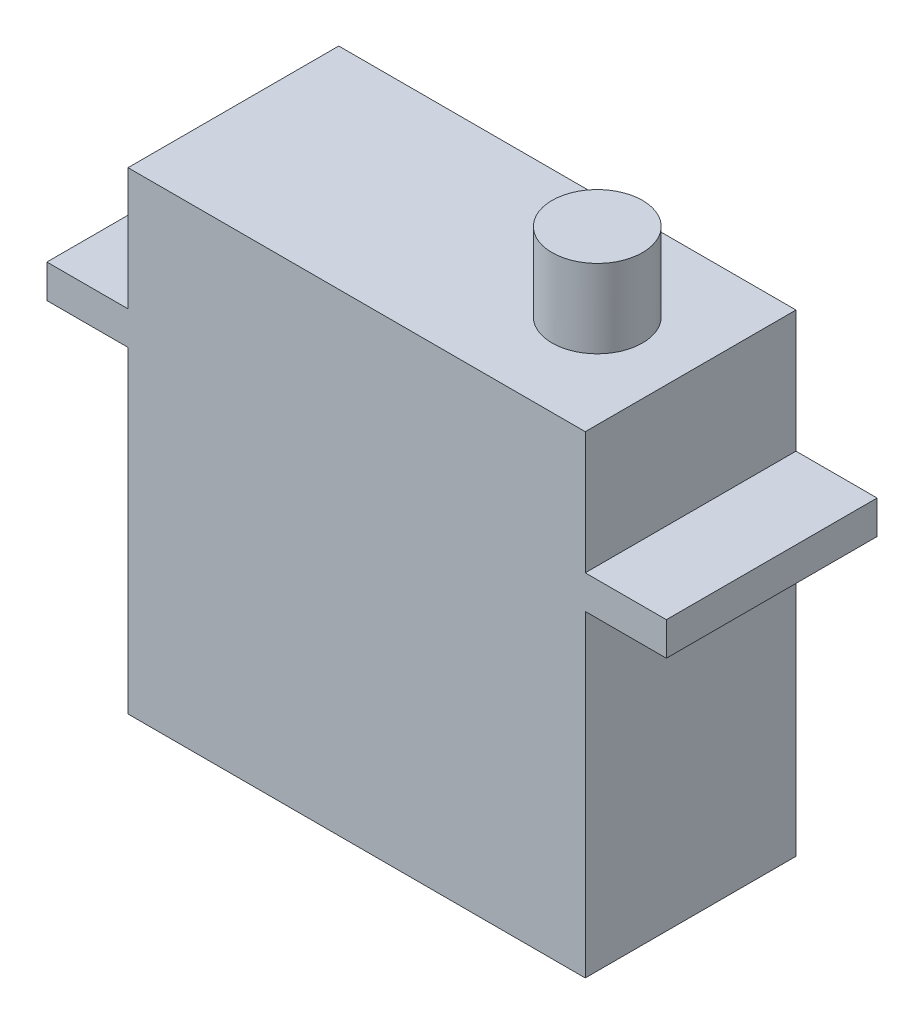
ISO-10303-21;
HEADER;
FILE_DESCRIPTION(('STEP AP214'),'2;1');
FILE_NAME('part.step','',(''),(''),'','','');
FILE_SCHEMA(('AUTOMOTIVE_DESIGN { 1 0 10303 214 1 1 1 1 }'));
ENDSEC;
DATA;
#1=APPLICATION_CONTEXT('core data for automotive mechanical design processes');
#2=APPLICATION_PROTOCOL_DEFINITION('international standard','automotive_design',2000,#1);
#3=PRODUCT_CONTEXT('',#1,'mechanical');
#4=PRODUCT('Part','Part','',(#3));
#5=PRODUCT_RELATED_PRODUCT_CATEGORY('part','',(#4));
#6=PRODUCT_DEFINITION_FORMATION('','',#4);
#7=PRODUCT_DEFINITION_CONTEXT('part definition',#1,'design');
#8=PRODUCT_DEFINITION('design','',#6,#7);
#9=PRODUCT_DEFINITION_SHAPE('','',#8);
#10=(LENGTH_UNIT() NAMED_UNIT(*) SI_UNIT(.MILLI.,.METRE.));
#11=(NAMED_UNIT(*) PLANE_ANGLE_UNIT() SI_UNIT($,.RADIAN.));
#12=(NAMED_UNIT(*) SI_UNIT($,.STERADIAN.) SOLID_ANGLE_UNIT());
#13=UNCERTAINTY_MEASURE_WITH_UNIT(LENGTH_MEASURE(1.E-05),#10,'distance_accuracy_value','');
#14=(GEOMETRIC_REPRESENTATION_CONTEXT(3) GLOBAL_UNCERTAINTY_ASSIGNED_CONTEXT((#13)) GLOBAL_UNIT_ASSIGNED_CONTEXT((#10,
#11,#12)) REPRESENTATION_CONTEXT('',''));
#15=CARTESIAN_POINT('',(0.,0.,0.));
#16=DIRECTION('',(0.,0.,1.));
#17=DIRECTION('',(1.,0.,0.));
#18=AXIS2_PLACEMENT_3D('',#15,#16,#17);
#19=CARTESIAN_POINT('',(-14.605,15.113,6.731));
#20=DIRECTION('',(0.,-1.,0.));
#21=DIRECTION('',(0.,0.,-1.));
#22=AXIS2_PLACEMENT_3D('',#19,#20,#21);
#23=PLANE('',#22);
#24=DIRECTION('',(-1.,0.,0.));
#25=VECTOR('',#24,1.);
#26=CARTESIAN_POINT('',(-14.605,15.113,-6.731));
#27=LINE('',#26,#25);
#28=CARTESIAN_POINT('',(14.605,15.113,-6.731));
#29=VERTEX_POINT('',#28);
#30=CARTESIAN_POINT('',(-14.605,15.113,-6.731));
#31=VERTEX_POINT('',#30);
#32=EDGE_CURVE('E220',#29,#31,#27,.T.);
#33=ORIENTED_EDGE('',*,*,#32,.T.);
#34=DIRECTION('',(0.,0.,-1.));
#35=VECTOR('',#34,1.);
#36=CARTESIAN_POINT('',(-14.605,15.113,6.731));
#37=LINE('',#36,#35);
#38=CARTESIAN_POINT('',(-14.605,15.113,6.731));
#39=VERTEX_POINT('',#38);
#40=EDGE_CURVE('E235',#39,#31,#37,.T.);
#41=ORIENTED_EDGE('',*,*,#40,.F.);
#42=DIRECTION('',(-1.,0.,0.));
#43=VECTOR('',#42,1.);
#44=CARTESIAN_POINT('',(-14.605,15.113,6.731));
#45=LINE('',#44,#43);
#46=CARTESIAN_POINT('',(14.605,15.113,6.731));
#47=VERTEX_POINT('',#46);
#48=EDGE_CURVE('E208',#47,#39,#45,.T.);
#49=ORIENTED_EDGE('',*,*,#48,.F.);
#50=DIRECTION('',(0.,0.,-1.));
#51=VECTOR('',#50,1.);
#52=CARTESIAN_POINT('',(14.605,15.113,6.731));
#53=LINE('',#52,#51);
#54=EDGE_CURVE('E41',#47,#29,#53,.T.);
#55=ORIENTED_EDGE('',*,*,#54,.T.);
#56=EDGE_LOOP('',(#33,#41,#49,#55));
#57=FACE_BOUND('',#56,.T.);
#58=CARTESIAN_POINT('',(8.64234999999999,15.113,0.));
#59=DIRECTION('',(0.,-1.,0.));
#60=DIRECTION('',(0.,0.,-1.));
#61=AXIS2_PLACEMENT_3D('',#58,#59,#60);
#62=CIRCLE('',#61,2.88925);
#63=CARTESIAN_POINT('',(8.64234999999999,15.113,-2.88925));
#64=VERTEX_POINT('',#63);
#65=EDGE_CURVE('E11',#64,#64,#62,.F.);
#66=ORIENTED_EDGE('',*,*,#65,.F.);
#67=EDGE_LOOP('',(#66));
#68=FACE_BOUND('',#67,.T.);
#69=ADVANCED_FACE('F33',(#57,#68),#23,.F.);
#70=CARTESIAN_POINT('',(14.605,15.113,6.731));
#71=DIRECTION('',(-1.,0.,0.));
#72=DIRECTION('',(0.,-1.,0.));
#73=AXIS2_PLACEMENT_3D('',#70,#71,#72);
#74=PLANE('',#73);
#75=DIRECTION('',(0.,0.,1.));
#76=VECTOR('',#75,1.);
#77=CARTESIAN_POINT('',(14.605,7.3025,-12.3346798195472));
#78=LINE('',#77,#76);
#79=CARTESIAN_POINT('',(14.605,7.3025,-6.731));
#80=VERTEX_POINT('',#79);
#81=CARTESIAN_POINT('',(14.605,7.3025,6.731));
#82=VERTEX_POINT('',#81);
#83=EDGE_CURVE('E56',#80,#82,#78,.T.);
#84=ORIENTED_EDGE('',*,*,#83,.F.);
#85=DIRECTION('',(0.,1.,0.));
#86=VECTOR('',#85,1.);
#87=CARTESIAN_POINT('',(14.605,15.113,-6.731));
#88=LINE('',#87,#86);
#89=EDGE_CURVE('E194',#80,#29,#88,.T.);
#90=ORIENTED_EDGE('',*,*,#89,.T.);
#91=ORIENTED_EDGE('',*,*,#54,.F.);
#92=DIRECTION('',(0.,1.,0.));
#93=VECTOR('',#92,1.);
#94=CARTESIAN_POINT('',(14.605,15.113,6.731));
#95=LINE('',#94,#93);
#96=EDGE_CURVE('E121',#82,#47,#95,.T.);
#97=ORIENTED_EDGE('',*,*,#96,.F.);
#98=EDGE_LOOP('',(#84,#90,#91,#97));
#99=FACE_BOUND('',#98,.T.);
#100=ADVANCED_FACE('F122',(#99),#74,.F.);
#101=CARTESIAN_POINT('',(-14.605,15.113,6.731));
#102=DIRECTION('',(1.,0.,0.));
#103=DIRECTION('',(0.,1.,0.));
#104=AXIS2_PLACEMENT_3D('',#101,#102,#103);
#105=PLANE('',#104);
#106=DIRECTION('',(0.,0.,1.));
#107=VECTOR('',#106,1.);
#108=CARTESIAN_POINT('',(-14.605,5.1689,-12.3346798195472));
#109=LINE('',#108,#107);
#110=CARTESIAN_POINT('',(-14.605,5.1689,-6.731));
#111=VERTEX_POINT('',#110);
#112=CARTESIAN_POINT('',(-14.605,5.1689,6.731));
#113=VERTEX_POINT('',#112);
#114=EDGE_CURVE('E176',#111,#113,#109,.T.);
#115=ORIENTED_EDGE('',*,*,#114,.F.);
#116=DIRECTION('',(0.,-1.,0.));
#117=VECTOR('',#116,1.);
#118=CARTESIAN_POINT('',(-14.605,15.113,-6.731));
#119=LINE('',#118,#117);
#120=CARTESIAN_POINT('',(-14.605,-15.113,-6.731));
#121=VERTEX_POINT('',#120);
#122=EDGE_CURVE('E223',#111,#121,#119,.T.);
#123=ORIENTED_EDGE('',*,*,#122,.T.);
#124=DIRECTION('',(0.,0.,-1.));
#125=VECTOR('',#124,1.);
#126=CARTESIAN_POINT('',(-14.605,-15.113,6.731));
#127=LINE('',#126,#125);
#128=CARTESIAN_POINT('',(-14.605,-15.113,6.731));
#129=VERTEX_POINT('',#128);
#130=EDGE_CURVE('E238',#129,#121,#127,.T.);
#131=ORIENTED_EDGE('',*,*,#130,.F.);
#132=DIRECTION('',(0.,-1.,0.));
#133=VECTOR('',#132,1.);
#134=CARTESIAN_POINT('',(-14.605,15.113,6.731));
#135=LINE('',#134,#133);
#136=EDGE_CURVE('E247',#113,#129,#135,.T.);
#137=ORIENTED_EDGE('',*,*,#136,.F.);
#138=EDGE_LOOP('',(#115,#123,#131,#137));
#139=FACE_BOUND('',#138,.T.);
#140=ADVANCED_FACE('F279',(#139),#105,.F.);
#141=CARTESIAN_POINT('',(14.605,-15.113,-6.731));
#142=VERTEX_POINT('',#141);
#143=CARTESIAN_POINT('',(14.605,5.1689,-6.731));
#144=VERTEX_POINT('',#143);
#145=EDGE_CURVE('E215',#142,#144,#88,.T.);
#146=ORIENTED_EDGE('',*,*,#145,.T.);
#147=DIRECTION('',(0.,0.,1.));
#148=VECTOR('',#147,1.);
#149=CARTESIAN_POINT('',(14.605,5.1689,-12.3346798195472));
#150=LINE('',#149,#148);
#151=CARTESIAN_POINT('',(14.605,5.1689,6.731));
#152=VERTEX_POINT('',#151);
#153=EDGE_CURVE('E48',#144,#152,#150,.T.);
#154=ORIENTED_EDGE('',*,*,#153,.T.);
#155=CARTESIAN_POINT('',(14.605,-15.113,6.731));
#156=VERTEX_POINT('',#155);
#157=EDGE_CURVE('E127',#156,#152,#95,.T.);
#158=ORIENTED_EDGE('',*,*,#157,.F.);
#159=DIRECTION('',(0.,0.,-1.));
#160=VECTOR('',#159,1.);
#161=CARTESIAN_POINT('',(14.605,-15.113,6.731));
#162=LINE('',#161,#160);
#163=EDGE_CURVE('E240',#156,#142,#162,.T.);
#164=ORIENTED_EDGE('',*,*,#163,.T.);
#165=EDGE_LOOP('',(#146,#154,#158,#164));
#166=FACE_BOUND('',#165,.T.);
#167=ADVANCED_FACE('F35',(#166),#74,.F.);
#168=CARTESIAN_POINT('',(-14.605,7.3025,-6.731));
#169=VERTEX_POINT('',#168);
#170=EDGE_CURVE('E231',#31,#169,#119,.T.);
#171=ORIENTED_EDGE('',*,*,#170,.T.);
#172=DIRECTION('',(0.,0.,1.));
#173=VECTOR('',#172,1.);
#174=CARTESIAN_POINT('',(-14.605,7.3025,-12.3346798195472));
#175=LINE('',#174,#173);
#176=CARTESIAN_POINT('',(-14.605,7.3025,6.731));
#177=VERTEX_POINT('',#176);
#178=EDGE_CURVE('E186',#169,#177,#175,.T.);
#179=ORIENTED_EDGE('',*,*,#178,.T.);
#180=EDGE_CURVE('E244',#39,#177,#135,.T.);
#181=ORIENTED_EDGE('',*,*,#180,.F.);
#182=ORIENTED_EDGE('',*,*,#40,.T.);
#183=EDGE_LOOP('',(#171,#179,#181,#182));
#184=FACE_BOUND('',#183,.T.);
#185=ADVANCED_FACE('F261',(#184),#105,.F.);
#186=CARTESIAN_POINT('',(-14.605,-15.113,6.731));
#187=DIRECTION('',(0.,1.,0.));
#188=DIRECTION('',(0.,0.,1.));
#189=AXIS2_PLACEMENT_3D('',#186,#187,#188);
#190=PLANE('',#189);
#191=DIRECTION('',(1.,0.,0.));
#192=VECTOR('',#191,1.);
#193=CARTESIAN_POINT('',(-14.605,-15.113,-6.731));
#194=LINE('',#193,#192);
#195=EDGE_CURVE('E128',#121,#142,#194,.T.);
#196=ORIENTED_EDGE('',*,*,#195,.T.);
#197=ORIENTED_EDGE('',*,*,#163,.F.);
#198=DIRECTION('',(1.,0.,0.));
#199=VECTOR('',#198,1.);
#200=CARTESIAN_POINT('',(-14.605,-15.113,6.731));
#201=LINE('',#200,#199);
#202=EDGE_CURVE('E219',#129,#156,#201,.T.);
#203=ORIENTED_EDGE('',*,*,#202,.F.);
#204=ORIENTED_EDGE('',*,*,#130,.T.);
#205=EDGE_LOOP('',(#196,#197,#203,#204));
#206=FACE_BOUND('',#205,.T.);
#207=ADVANCED_FACE('F282',(#206),#190,.F.);
#208=CARTESIAN_POINT('',(0.,0.,6.731));
#209=DIRECTION('',(0.,0.,1.));
#210=DIRECTION('',(1.,0.,0.));
#211=AXIS2_PLACEMENT_3D('',#208,#209,#210);
#212=PLANE('',#211);
#213=ORIENTED_EDGE('',*,*,#157,.T.);
#214=DIRECTION('',(1.,0.,0.));
#215=VECTOR('',#214,1.);
#216=CARTESIAN_POINT('',(14.605,5.1689,6.731));
#217=LINE('',#216,#215);
#218=CARTESIAN_POINT('',(19.7866,5.1689,6.731));
#219=VERTEX_POINT('',#218);
#220=EDGE_CURVE('E147',#152,#219,#217,.T.);
#221=ORIENTED_EDGE('',*,*,#220,.T.);
#222=DIRECTION('',(0.,-1.,0.));
#223=VECTOR('',#222,1.);
#224=CARTESIAN_POINT('',(19.7866,7.3025,6.731));
#225=LINE('',#224,#223);
#226=CARTESIAN_POINT('',(19.7866,7.3025,6.731));
#227=VERTEX_POINT('',#226);
#228=EDGE_CURVE('E144',#227,#219,#225,.T.);
#229=ORIENTED_EDGE('',*,*,#228,.F.);
#230=DIRECTION('',(1.,0.,0.));
#231=VECTOR('',#230,1.);
#232=CARTESIAN_POINT('',(14.605,7.3025,6.731));
#233=LINE('',#232,#231);
#234=EDGE_CURVE('E135',#82,#227,#233,.T.);
#235=ORIENTED_EDGE('',*,*,#234,.F.);
#236=ORIENTED_EDGE('',*,*,#96,.T.);
#237=ORIENTED_EDGE('',*,*,#48,.T.);
#238=ORIENTED_EDGE('',*,*,#180,.T.);
#239=DIRECTION('',(-1.,0.,0.));
#240=VECTOR('',#239,1.);
#241=CARTESIAN_POINT('',(-14.605,7.3025,6.731));
#242=LINE('',#241,#240);
#243=CARTESIAN_POINT('',(-19.7866,7.3025,6.731));
#244=VERTEX_POINT('',#243);
#245=EDGE_CURVE('E180',#177,#244,#242,.T.);
#246=ORIENTED_EDGE('',*,*,#245,.T.);
#247=DIRECTION('',(0.,-1.,0.));
#248=VECTOR('',#247,1.);
#249=CARTESIAN_POINT('',(-19.7866,7.3025,6.731));
#250=LINE('',#249,#248);
#251=CARTESIAN_POINT('',(-19.7866,5.1689,6.731));
#252=VERTEX_POINT('',#251);
#253=EDGE_CURVE('E177',#244,#252,#250,.T.);
#254=ORIENTED_EDGE('',*,*,#253,.T.);
#255=DIRECTION('',(-1.,0.,0.));
#256=VECTOR('',#255,1.);
#257=CARTESIAN_POINT('',(-14.605,5.1689,6.731));
#258=LINE('',#257,#256);
#259=EDGE_CURVE('E161',#113,#252,#258,.T.);
#260=ORIENTED_EDGE('',*,*,#259,.F.);
#261=ORIENTED_EDGE('',*,*,#136,.T.);
#262=ORIENTED_EDGE('',*,*,#202,.T.);
#263=EDGE_LOOP('',(#213,#221,#229,#235,#236,#237,#238,#246,#254,#260,#261,#262));
#264=FACE_BOUND('',#263,.T.);
#265=ADVANCED_FACE('F141',(#264),#212,.T.);
#266=CARTESIAN_POINT('',(0.,0.,-6.731));
#267=DIRECTION('',(0.,0.,1.));
#268=DIRECTION('',(1.,0.,0.));
#269=AXIS2_PLACEMENT_3D('',#266,#267,#268);
#270=PLANE('',#269);
#271=ORIENTED_EDGE('',*,*,#145,.F.);
#272=ORIENTED_EDGE('',*,*,#195,.F.);
#273=ORIENTED_EDGE('',*,*,#122,.F.);
#274=DIRECTION('',(1.,0.,0.));
#275=VECTOR('',#274,1.);
#276=CARTESIAN_POINT('',(-14.605,5.1689,-6.731));
#277=LINE('',#276,#275);
#278=CARTESIAN_POINT('',(-19.7866,5.1689,-6.731));
#279=VERTEX_POINT('',#278);
#280=EDGE_CURVE('E175',#279,#111,#277,.T.);
#281=ORIENTED_EDGE('',*,*,#280,.F.);
#282=DIRECTION('',(0.,1.,0.));
#283=VECTOR('',#282,1.);
#284=CARTESIAN_POINT('',(-19.7866,7.3025,-6.731));
#285=LINE('',#284,#283);
#286=CARTESIAN_POINT('',(-19.7866,7.3025,-6.731));
#287=VERTEX_POINT('',#286);
#288=EDGE_CURVE('E173',#279,#287,#285,.T.);
#289=ORIENTED_EDGE('',*,*,#288,.T.);
#290=DIRECTION('',(1.,0.,0.));
#291=VECTOR('',#290,1.);
#292=CARTESIAN_POINT('',(-14.605,7.3025,-6.731));
#293=LINE('',#292,#291);
#294=EDGE_CURVE('E192',#287,#169,#293,.T.);
#295=ORIENTED_EDGE('',*,*,#294,.T.);
#296=ORIENTED_EDGE('',*,*,#170,.F.);
#297=ORIENTED_EDGE('',*,*,#32,.F.);
#298=ORIENTED_EDGE('',*,*,#89,.F.);
#299=DIRECTION('',(-1.,0.,0.));
#300=VECTOR('',#299,1.);
#301=CARTESIAN_POINT('',(14.605,7.3025,-6.731));
#302=LINE('',#301,#300);
#303=CARTESIAN_POINT('',(19.7866,7.3025,-6.731));
#304=VERTEX_POINT('',#303);
#305=EDGE_CURVE('E137',#304,#80,#302,.T.);
#306=ORIENTED_EDGE('',*,*,#305,.F.);
#307=DIRECTION('',(0.,1.,0.));
#308=VECTOR('',#307,1.);
#309=CARTESIAN_POINT('',(19.7866,7.3025,-6.731));
#310=LINE('',#309,#308);
#311=CARTESIAN_POINT('',(19.7866,5.1689,-6.731));
#312=VERTEX_POINT('',#311);
#313=EDGE_CURVE('E138',#312,#304,#310,.T.);
#314=ORIENTED_EDGE('',*,*,#313,.F.);
#315=DIRECTION('',(-1.,0.,0.));
#316=VECTOR('',#315,1.);
#317=CARTESIAN_POINT('',(14.605,5.1689,-6.731));
#318=LINE('',#317,#316);
#319=EDGE_CURVE('E156',#312,#144,#318,.T.);
#320=ORIENTED_EDGE('',*,*,#319,.T.);
#321=EDGE_LOOP('',(#271,#272,#273,#281,#289,#295,#296,#297,#298,#306,#314,#320));
#322=FACE_BOUND('',#321,.T.);
#323=ADVANCED_FACE('F266',(#322),#270,.F.);
#324=CARTESIAN_POINT('',(-14.605,5.1689,-12.3346798195472));
#325=DIRECTION('',(0.,1.,0.));
#326=DIRECTION('',(-1.,0.,0.));
#327=AXIS2_PLACEMENT_3D('',#324,#325,#326);
#328=PLANE('',#327);
#329=DIRECTION('',(0.,0.,1.));
#330=VECTOR('',#329,1.);
#331=CARTESIAN_POINT('',(-19.7866,5.1689,-12.3346798195472));
#332=LINE('',#331,#330);
#333=EDGE_CURVE('E202',#279,#252,#332,.T.);
#334=ORIENTED_EDGE('',*,*,#333,.F.);
#335=ORIENTED_EDGE('',*,*,#280,.T.);
#336=ORIENTED_EDGE('',*,*,#114,.T.);
#337=ORIENTED_EDGE('',*,*,#259,.T.);
#338=EDGE_LOOP('',(#334,#335,#336,#337));
#339=FACE_BOUND('',#338,.T.);
#340=ADVANCED_FACE('F274',(#339),#328,.F.);
#341=CARTESIAN_POINT('',(-19.7866,7.3025,-12.3346798195472));
#342=DIRECTION('',(-1.,0.,0.));
#343=DIRECTION('',(0.,-1.,0.));
#344=AXIS2_PLACEMENT_3D('',#341,#342,#343);
#345=PLANE('',#344);
#346=ORIENTED_EDGE('',*,*,#288,.F.);
#347=ORIENTED_EDGE('',*,*,#333,.T.);
#348=ORIENTED_EDGE('',*,*,#253,.F.);
#349=DIRECTION('',(0.,0.,1.));
#350=VECTOR('',#349,1.);
#351=CARTESIAN_POINT('',(-19.7866,7.3025,-12.3346798195472));
#352=LINE('',#351,#350);
#353=EDGE_CURVE('E183',#287,#244,#352,.T.);
#354=ORIENTED_EDGE('',*,*,#353,.F.);
#355=EDGE_LOOP('',(#346,#347,#348,#354));
#356=FACE_BOUND('',#355,.T.);
#357=ADVANCED_FACE('F271',(#356),#345,.T.);
#358=CARTESIAN_POINT('',(-14.605,7.3025,-12.3346798195472));
#359=DIRECTION('',(0.,1.,0.));
#360=DIRECTION('',(-1.,0.,0.));
#361=AXIS2_PLACEMENT_3D('',#358,#359,#360);
#362=PLANE('',#361);
#363=ORIENTED_EDGE('',*,*,#294,.F.);
#364=ORIENTED_EDGE('',*,*,#353,.T.);
#365=ORIENTED_EDGE('',*,*,#245,.F.);
#366=ORIENTED_EDGE('',*,*,#178,.F.);
#367=EDGE_LOOP('',(#363,#364,#365,#366));
#368=FACE_BOUND('',#367,.T.);
#369=ADVANCED_FACE('F258',(#368),#362,.T.);
#370=CARTESIAN_POINT('',(14.605,7.3025,-12.3346798195472));
#371=DIRECTION('',(0.,-1.,0.));
#372=DIRECTION('',(1.,0.,0.));
#373=AXIS2_PLACEMENT_3D('',#370,#371,#372);
#374=PLANE('',#373);
#375=DIRECTION('',(0.,0.,1.));
#376=VECTOR('',#375,1.);
#377=CARTESIAN_POINT('',(19.7866,7.3025,-12.3346798195472));
#378=LINE('',#377,#376);
#379=EDGE_CURVE('E139',#304,#227,#378,.T.);
#380=ORIENTED_EDGE('',*,*,#379,.F.);
#381=ORIENTED_EDGE('',*,*,#305,.T.);
#382=ORIENTED_EDGE('',*,*,#83,.T.);
#383=ORIENTED_EDGE('',*,*,#234,.T.);
#384=EDGE_LOOP('',(#380,#381,#382,#383));
#385=FACE_BOUND('',#384,.T.);
#386=ADVANCED_FACE('F134',(#385),#374,.F.);
#387=CARTESIAN_POINT('',(19.7866,7.3025,-12.3346798195472));
#388=DIRECTION('',(-1.,0.,0.));
#389=DIRECTION('',(0.,-1.,0.));
#390=AXIS2_PLACEMENT_3D('',#387,#388,#389);
#391=PLANE('',#390);
#392=DIRECTION('',(0.,0.,1.));
#393=VECTOR('',#392,1.);
#394=CARTESIAN_POINT('',(19.7866,5.1689,-12.3346798195472));
#395=LINE('',#394,#393);
#396=EDGE_CURVE('E166',#312,#219,#395,.T.);
#397=ORIENTED_EDGE('',*,*,#396,.F.);
#398=ORIENTED_EDGE('',*,*,#313,.T.);
#399=ORIENTED_EDGE('',*,*,#379,.T.);
#400=ORIENTED_EDGE('',*,*,#228,.T.);
#401=EDGE_LOOP('',(#397,#398,#399,#400));
#402=FACE_BOUND('',#401,.T.);
#403=ADVANCED_FACE('F290',(#402),#391,.F.);
#404=CARTESIAN_POINT('',(14.605,5.1689,-12.3346798195472));
#405=DIRECTION('',(0.,-1.,0.));
#406=DIRECTION('',(1.,0.,0.));
#407=AXIS2_PLACEMENT_3D('',#404,#405,#406);
#408=PLANE('',#407);
#409=ORIENTED_EDGE('',*,*,#319,.F.);
#410=ORIENTED_EDGE('',*,*,#396,.T.);
#411=ORIENTED_EDGE('',*,*,#220,.F.);
#412=ORIENTED_EDGE('',*,*,#153,.F.);
#413=EDGE_LOOP('',(#409,#410,#411,#412));
#414=FACE_BOUND('',#413,.T.);
#415=ADVANCED_FACE('F286',(#414),#408,.T.);
#416=CARTESIAN_POINT('',(8.64234999999999,20.1168,0.));
#417=DIRECTION('',(0.,-1.,0.));
#418=DIRECTION('',(0.,0.,-1.));
#419=AXIS2_PLACEMENT_3D('',#416,#417,#418);
#420=CYLINDRICAL_SURFACE('',#419,2.88925);
#421=CARTESIAN_POINT('',(8.64234999999999,20.1168,0.));
#422=DIRECTION('',(0.,1.,0.));
#423=DIRECTION('',(0.,0.,1.));
#424=AXIS2_PLACEMENT_3D('',#421,#422,#423);
#425=CIRCLE('',#424,2.88925);
#426=CARTESIAN_POINT('',(8.64234999999999,20.1168,2.88925));
#427=VERTEX_POINT('',#426);
#428=EDGE_CURVE('E145',#427,#427,#425,.T.);
#429=ORIENTED_EDGE('',*,*,#428,.F.);
#430=EDGE_LOOP('',(#429));
#431=FACE_BOUND('',#430,.T.);
#432=ORIENTED_EDGE('',*,*,#65,.T.);
#433=EDGE_LOOP('',(#432));
#434=FACE_BOUND('',#433,.T.);
#435=ADVANCED_FACE('F297',(#431,#434),#420,.T.);
#436=CARTESIAN_POINT('',(8.64234999999999,20.1168,0.));
#437=DIRECTION('',(0.,1.,0.));
#438=DIRECTION('',(0.,0.,1.));
#439=AXIS2_PLACEMENT_3D('',#436,#437,#438);
#440=PLANE('',#439);
#441=ORIENTED_EDGE('',*,*,#428,.T.);
#442=EDGE_LOOP('',(#441));
#443=FACE_BOUND('',#442,.T.);
#444=ADVANCED_FACE('F356',(#443),#440,.T.);
#445=CLOSED_SHELL('',(#69,#100,#140,#167,#185,#207,#265,#323,#340,#357,#369,#386,#403,#415,#435,#444));
#446=MANIFOLD_SOLID_BREP('B2',#445);
#447=ADVANCED_BREP_SHAPE_REPRESENTATION('',(#18,#446),#14);
#448=SHAPE_DEFINITION_REPRESENTATION(#9,#447);
ENDSEC;
END-ISO-10303-21;
